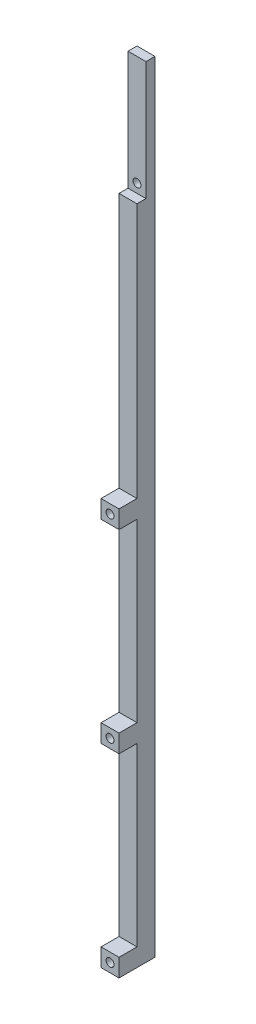
ISO-10303-21;
HEADER;
FILE_DESCRIPTION(('STEP AP214'),'2;1');
FILE_NAME('part.step','',(''),(''),'','','');
FILE_SCHEMA(('AUTOMOTIVE_DESIGN { 1 0 10303 214 1 1 1 1 }'));
ENDSEC;
DATA;
#1=APPLICATION_CONTEXT('core data for automotive mechanical design processes');
#2=APPLICATION_PROTOCOL_DEFINITION('international standard','automotive_design',2000,#1);
#3=PRODUCT_CONTEXT('',#1,'mechanical');
#4=PRODUCT('Part','Part','',(#3));
#5=PRODUCT_RELATED_PRODUCT_CATEGORY('part','',(#4));
#6=PRODUCT_DEFINITION_FORMATION('','',#4);
#7=PRODUCT_DEFINITION_CONTEXT('part definition',#1,'design');
#8=PRODUCT_DEFINITION('design','',#6,#7);
#9=PRODUCT_DEFINITION_SHAPE('','',#8);
#10=(LENGTH_UNIT() NAMED_UNIT(*) SI_UNIT(.MILLI.,.METRE.));
#11=(NAMED_UNIT(*) PLANE_ANGLE_UNIT() SI_UNIT($,.RADIAN.));
#12=(NAMED_UNIT(*) SI_UNIT($,.STERADIAN.) SOLID_ANGLE_UNIT());
#13=UNCERTAINTY_MEASURE_WITH_UNIT(LENGTH_MEASURE(1.E-05),#10,'distance_accuracy_value','');
#14=(GEOMETRIC_REPRESENTATION_CONTEXT(3) GLOBAL_UNCERTAINTY_ASSIGNED_CONTEXT((#13)) GLOBAL_UNIT_ASSIGNED_CONTEXT((#10,
#11,#12)) REPRESENTATION_CONTEXT('',''));
#15=CARTESIAN_POINT('',(0.,0.,0.));
#16=DIRECTION('',(0.,0.,1.));
#17=DIRECTION('',(1.,0.,0.));
#18=AXIS2_PLACEMENT_3D('',#15,#16,#17);
#19=CARTESIAN_POINT('',(0.,275.59,0.));
#20=DIRECTION('',(0.,0.,-1.));
#21=DIRECTION('',(-1.,0.,0.));
#22=AXIS2_PLACEMENT_3D('',#19,#20,#21);
#23=PLANE('',#22);
#24=CARTESIAN_POINT('',(3.175,140.335,0.));
#25=DIRECTION('',(0.,0.,1.));
#26=DIRECTION('',(1.,0.,0.));
#27=AXIS2_PLACEMENT_3D('',#24,#25,#26);
#28=CIRCLE('',#27,1.397);
#29=CARTESIAN_POINT('',(4.57199999999999,140.335,0.));
#30=VERTEX_POINT('',#29);
#31=EDGE_CURVE('E416',#30,#30,#28,.T.);
#32=ORIENTED_EDGE('',*,*,#31,.F.);
#33=EDGE_LOOP('',(#32));
#34=FACE_BOUND('',#33,.T.);
#35=DIRECTION('',(0.,-1.,0.));
#36=VECTOR('',#35,1.);
#37=CARTESIAN_POINT('',(6.35,275.59,0.));
#38=LINE('',#37,#36);
#39=CARTESIAN_POINT('',(6.35,143.50989967,0.));
#40=VERTEX_POINT('',#39);
#41=CARTESIAN_POINT('',(6.35,137.16010033,0.));
#42=VERTEX_POINT('',#41);
#43=EDGE_CURVE('E226',#40,#42,#38,.T.);
#44=ORIENTED_EDGE('',*,*,#43,.F.);
#45=DIRECTION('',(-1.,0.,0.));
#46=VECTOR('',#45,1.);
#47=CARTESIAN_POINT('',(0.,143.50989967,0.));
#48=LINE('',#47,#46);
#49=CARTESIAN_POINT('',(0.,143.50989967,0.));
#50=VERTEX_POINT('',#49);
#51=EDGE_CURVE('E147',#40,#50,#48,.T.);
#52=ORIENTED_EDGE('',*,*,#51,.T.);
#53=DIRECTION('',(0.,-1.,0.));
#54=VECTOR('',#53,1.);
#55=CARTESIAN_POINT('',(0.,275.59,0.));
#56=LINE('',#55,#54);
#57=CARTESIAN_POINT('',(0.,137.16010033,0.));
#58=VERTEX_POINT('',#57);
#59=EDGE_CURVE('E222',#50,#58,#56,.T.);
#60=ORIENTED_EDGE('',*,*,#59,.T.);
#61=DIRECTION('',(1.,0.,0.));
#62=VECTOR('',#61,1.);
#63=CARTESIAN_POINT('',(0.,137.16010033,0.));
#64=LINE('',#63,#62);
#65=EDGE_CURVE('E221',#58,#42,#64,.T.);
#66=ORIENTED_EDGE('',*,*,#65,.T.);
#67=EDGE_LOOP('',(#44,#52,#60,#66));
#68=FACE_BOUND('',#67,.T.);
#69=ADVANCED_FACE('F129',(#34,#68),#23,.F.);
#70=CARTESIAN_POINT('',(3.17500000000003,3.175,0.));
#71=DIRECTION('',(0.,0.,1.));
#72=DIRECTION('',(1.,0.,0.));
#73=AXIS2_PLACEMENT_3D('',#70,#71,#72);
#74=CIRCLE('',#73,1.397);
#75=CARTESIAN_POINT('',(4.57200000000002,3.175,0.));
#76=VERTEX_POINT('',#75);
#77=EDGE_CURVE('E413',#76,#76,#74,.T.);
#78=ORIENTED_EDGE('',*,*,#77,.F.);
#79=EDGE_LOOP('',(#78));
#80=FACE_BOUND('',#79,.T.);
#81=DIRECTION('',(1.,0.,0.));
#82=VECTOR('',#81,1.);
#83=CARTESIAN_POINT('',(0.,6.34989966999999,0.));
#84=LINE('',#83,#82);
#85=CARTESIAN_POINT('',(0.,6.34989967,0.));
#86=VERTEX_POINT('',#85);
#87=CARTESIAN_POINT('',(6.35,6.34989967,0.));
#88=VERTEX_POINT('',#87);
#89=EDGE_CURVE('E258',#86,#88,#84,.T.);
#90=ORIENTED_EDGE('',*,*,#89,.F.);
#91=CARTESIAN_POINT('',(0.,0.,0.));
#92=VERTEX_POINT('',#91);
#93=EDGE_CURVE('E217',#86,#92,#56,.T.);
#94=ORIENTED_EDGE('',*,*,#93,.T.);
#95=DIRECTION('',(1.,0.,0.));
#96=VECTOR('',#95,1.);
#97=CARTESIAN_POINT('',(0.,0.,0.));
#98=LINE('',#97,#96);
#99=CARTESIAN_POINT('',(6.35,0.,0.));
#100=VERTEX_POINT('',#99);
#101=EDGE_CURVE('E220',#92,#100,#98,.T.);
#102=ORIENTED_EDGE('',*,*,#101,.T.);
#103=EDGE_CURVE('E206',#88,#100,#38,.T.);
#104=ORIENTED_EDGE('',*,*,#103,.F.);
#105=EDGE_LOOP('',(#90,#94,#102,#104));
#106=FACE_BOUND('',#105,.T.);
#107=ADVANCED_FACE('F392',(#80,#106),#23,.F.);
#108=CARTESIAN_POINT('',(3.175,71.755,0.));
#109=DIRECTION('',(0.,0.,1.));
#110=DIRECTION('',(1.,0.,0.));
#111=AXIS2_PLACEMENT_3D('',#108,#109,#110);
#112=CIRCLE('',#111,1.397);
#113=CARTESIAN_POINT('',(4.572,71.755,0.));
#114=VERTEX_POINT('',#113);
#115=EDGE_CURVE('E407',#114,#114,#112,.T.);
#116=ORIENTED_EDGE('',*,*,#115,.F.);
#117=EDGE_LOOP('',(#116));
#118=FACE_BOUND('',#117,.T.);
#119=CARTESIAN_POINT('',(0.,74.92989967,0.));
#120=VERTEX_POINT('',#119);
#121=CARTESIAN_POINT('',(0.,68.58010033,0.));
#122=VERTEX_POINT('',#121);
#123=EDGE_CURVE('E223',#120,#122,#56,.T.);
#124=ORIENTED_EDGE('',*,*,#123,.T.);
#125=DIRECTION('',(1.,0.,0.));
#126=VECTOR('',#125,1.);
#127=CARTESIAN_POINT('',(0.,68.58010033,0.));
#128=LINE('',#127,#126);
#129=CARTESIAN_POINT('',(6.35,68.58010033,0.));
#130=VERTEX_POINT('',#129);
#131=EDGE_CURVE('E215',#122,#130,#128,.T.);
#132=ORIENTED_EDGE('',*,*,#131,.T.);
#133=CARTESIAN_POINT('',(6.35,74.92989967,0.));
#134=VERTEX_POINT('',#133);
#135=EDGE_CURVE('E227',#134,#130,#38,.T.);
#136=ORIENTED_EDGE('',*,*,#135,.F.);
#137=DIRECTION('',(1.,0.,0.));
#138=VECTOR('',#137,1.);
#139=CARTESIAN_POINT('',(0.,74.92989967,0.));
#140=LINE('',#139,#138);
#141=EDGE_CURVE('E275',#120,#134,#140,.T.);
#142=ORIENTED_EDGE('',*,*,#141,.F.);
#143=EDGE_LOOP('',(#124,#132,#136,#142));
#144=FACE_BOUND('',#143,.T.);
#145=ADVANCED_FACE('F328',(#118,#144),#23,.F.);
#146=CARTESIAN_POINT('',(0.,275.59,0.));
#147=DIRECTION('',(1.,0.,0.));
#148=DIRECTION('',(0.,0.,-1.));
#149=AXIS2_PLACEMENT_3D('',#146,#147,#148);
#150=PLANE('',#149);
#151=ORIENTED_EDGE('',*,*,#59,.F.);
#152=DIRECTION('',(0.,0.,1.));
#153=VECTOR('',#152,1.);
#154=CARTESIAN_POINT('',(0.,143.50989967,0.));
#155=LINE('',#154,#153);
#156=CARTESIAN_POINT('',(0.,143.50989967,-6.35010033));
#157=VERTEX_POINT('',#156);
#158=EDGE_CURVE('E12',#157,#50,#155,.T.);
#159=ORIENTED_EDGE('',*,*,#158,.F.);
#160=DIRECTION('',(0.,1.,0.));
#161=VECTOR('',#160,1.);
#162=CARTESIAN_POINT('',(0.,143.51,-6.35010033));
#163=LINE('',#162,#161);
#164=CARTESIAN_POINT('',(0.,233.67989967,-6.35010033));
#165=VERTEX_POINT('',#164);
#166=EDGE_CURVE('E192',#165,#157,#163,.F.);
#167=ORIENTED_EDGE('',*,*,#166,.F.);
#168=DIRECTION('',(0.,0.,-1.));
#169=VECTOR('',#168,1.);
#170=CARTESIAN_POINT('',(0.,233.67989967,6.80936496078033E-13));
#171=LINE('',#170,#169);
#172=CARTESIAN_POINT('',(0.,233.67989967,-9.52510033));
#173=VERTEX_POINT('',#172);
#174=EDGE_CURVE('E213',#165,#173,#171,.T.);
#175=ORIENTED_EDGE('',*,*,#174,.T.);
#176=DIRECTION('',(0.,-1.,0.));
#177=VECTOR('',#176,1.);
#178=CARTESIAN_POINT('',(0.,0.,-9.52510033));
#179=LINE('',#178,#177);
#180=CARTESIAN_POINT('',(0.,275.59,-9.52510033));
#181=VERTEX_POINT('',#180);
#182=EDGE_CURVE('E191',#181,#173,#179,.T.);
#183=ORIENTED_EDGE('',*,*,#182,.F.);
#184=DIRECTION('',(0.,0.,1.));
#185=VECTOR('',#184,1.);
#186=CARTESIAN_POINT('',(0.,275.59,0.));
#187=LINE('',#186,#185);
#188=CARTESIAN_POINT('',(0.,275.59,-12.7));
#189=VERTEX_POINT('',#188);
#190=EDGE_CURVE('E133',#189,#181,#187,.T.);
#191=ORIENTED_EDGE('',*,*,#190,.F.);
#192=DIRECTION('',(0.,-1.,0.));
#193=VECTOR('',#192,1.);
#194=CARTESIAN_POINT('',(0.,275.59,-12.7));
#195=LINE('',#194,#193);
#196=CARTESIAN_POINT('',(0.,0.,-12.7));
#197=VERTEX_POINT('',#196);
#198=EDGE_CURVE('E214',#189,#197,#195,.T.);
#199=ORIENTED_EDGE('',*,*,#198,.T.);
#200=DIRECTION('',(0.,0.,1.));
#201=VECTOR('',#200,1.);
#202=CARTESIAN_POINT('',(0.,0.,0.));
#203=LINE('',#202,#201);
#204=EDGE_CURVE('E252',#197,#92,#203,.T.);
#205=ORIENTED_EDGE('',*,*,#204,.T.);
#206=ORIENTED_EDGE('',*,*,#93,.F.);
#207=DIRECTION('',(0.,0.,-1.));
#208=VECTOR('',#207,1.);
#209=CARTESIAN_POINT('',(0.,6.34989967,0.));
#210=LINE('',#209,#208);
#211=CARTESIAN_POINT('',(0.,6.34989967,-6.35010032999999));
#212=VERTEX_POINT('',#211);
#213=EDGE_CURVE('E248',#86,#212,#210,.T.);
#214=ORIENTED_EDGE('',*,*,#213,.T.);
#215=DIRECTION('',(0.,-1.,0.));
#216=VECTOR('',#215,1.);
#217=CARTESIAN_POINT('',(0.,68.58,-6.35010033));
#218=LINE('',#217,#216);
#219=CARTESIAN_POINT('',(0.,68.58010033,-6.35010033));
#220=VERTEX_POINT('',#219);
#221=EDGE_CURVE('E243',#220,#212,#218,.T.);
#222=ORIENTED_EDGE('',*,*,#221,.F.);
#223=DIRECTION('',(0.,0.,-1.));
#224=VECTOR('',#223,1.);
#225=CARTESIAN_POINT('',(0.,68.58010033,0.));
#226=LINE('',#225,#224);
#227=EDGE_CURVE('E255',#122,#220,#226,.T.);
#228=ORIENTED_EDGE('',*,*,#227,.F.);
#229=ORIENTED_EDGE('',*,*,#123,.F.);
#230=DIRECTION('',(0.,0.,-1.));
#231=VECTOR('',#230,1.);
#232=CARTESIAN_POINT('',(0.,74.92989967,0.));
#233=LINE('',#232,#231);
#234=CARTESIAN_POINT('',(0.,74.92989967,-6.35010032999999));
#235=VERTEX_POINT('',#234);
#236=EDGE_CURVE('E251',#120,#235,#233,.T.);
#237=ORIENTED_EDGE('',*,*,#236,.T.);
#238=DIRECTION('',(0.,-1.,0.));
#239=VECTOR('',#238,1.);
#240=CARTESIAN_POINT('',(0.,137.16,-6.35010033));
#241=LINE('',#240,#239);
#242=CARTESIAN_POINT('',(0.,137.16010033,-6.35010033));
#243=VERTEX_POINT('',#242);
#244=EDGE_CURVE('E290',#243,#235,#241,.T.);
#245=ORIENTED_EDGE('',*,*,#244,.F.);
#246=DIRECTION('',(0.,0.,-1.));
#247=VECTOR('',#246,1.);
#248=CARTESIAN_POINT('',(0.,137.16010033,0.));
#249=LINE('',#248,#247);
#250=EDGE_CURVE('E233',#58,#243,#249,.T.);
#251=ORIENTED_EDGE('',*,*,#250,.F.);
#252=EDGE_LOOP('',(#151,#159,#167,#175,#183,#191,#199,#205,#206,#214,#222,#228,#229,#237,#245,#251));
#253=FACE_BOUND('',#252,.T.);
#254=ADVANCED_FACE('F131',(#253),#150,.F.);
#255=CARTESIAN_POINT('',(6.35,275.59,0.));
#256=DIRECTION('',(-1.,0.,0.));
#257=DIRECTION('',(0.,0.,1.));
#258=AXIS2_PLACEMENT_3D('',#255,#256,#257);
#259=PLANE('',#258);
#260=DIRECTION('',(0.,1.,0.));
#261=VECTOR('',#260,1.);
#262=CARTESIAN_POINT('',(6.35,143.51,-6.35010033));
#263=LINE('',#262,#261);
#264=CARTESIAN_POINT('',(6.35,233.67989967,-6.35010033));
#265=VERTEX_POINT('',#264);
#266=CARTESIAN_POINT('',(6.35,143.50989967,-6.35010033));
#267=VERTEX_POINT('',#266);
#268=EDGE_CURVE('E295',#265,#267,#263,.F.);
#269=ORIENTED_EDGE('',*,*,#268,.T.);
#270=DIRECTION('',(0.,0.,1.));
#271=VECTOR('',#270,1.);
#272=CARTESIAN_POINT('',(6.35,143.50989967,0.));
#273=LINE('',#272,#271);
#274=EDGE_CURVE('E308',#267,#40,#273,.T.);
#275=ORIENTED_EDGE('',*,*,#274,.T.);
#276=ORIENTED_EDGE('',*,*,#43,.T.);
#277=DIRECTION('',(0.,0.,-1.));
#278=VECTOR('',#277,1.);
#279=CARTESIAN_POINT('',(6.35,137.16010033,0.));
#280=LINE('',#279,#278);
#281=CARTESIAN_POINT('',(6.35,137.16010033,-6.35010033));
#282=VERTEX_POINT('',#281);
#283=EDGE_CURVE('E267',#42,#282,#280,.T.);
#284=ORIENTED_EDGE('',*,*,#283,.T.);
#285=DIRECTION('',(0.,-1.,0.));
#286=VECTOR('',#285,1.);
#287=CARTESIAN_POINT('',(6.35,137.16,-6.35010033));
#288=LINE('',#287,#286);
#289=CARTESIAN_POINT('',(6.35,74.92989967,-6.35010033));
#290=VERTEX_POINT('',#289);
#291=EDGE_CURVE('E270',#282,#290,#288,.T.);
#292=ORIENTED_EDGE('',*,*,#291,.T.);
#293=DIRECTION('',(0.,0.,-1.));
#294=VECTOR('',#293,1.);
#295=CARTESIAN_POINT('',(6.35,74.92989967,0.));
#296=LINE('',#295,#294);
#297=EDGE_CURVE('E271',#134,#290,#296,.T.);
#298=ORIENTED_EDGE('',*,*,#297,.F.);
#299=ORIENTED_EDGE('',*,*,#135,.T.);
#300=DIRECTION('',(0.,0.,-1.));
#301=VECTOR('',#300,1.);
#302=CARTESIAN_POINT('',(6.35,68.58010033,0.));
#303=LINE('',#302,#301);
#304=CARTESIAN_POINT('',(6.35,68.58010033,-6.35010033));
#305=VERTEX_POINT('',#304);
#306=EDGE_CURVE('E262',#130,#305,#303,.T.);
#307=ORIENTED_EDGE('',*,*,#306,.T.);
#308=DIRECTION('',(0.,-1.,0.));
#309=VECTOR('',#308,1.);
#310=CARTESIAN_POINT('',(6.35,68.58,-6.35010033));
#311=LINE('',#310,#309);
#312=CARTESIAN_POINT('',(6.35,6.34989966999999,-6.35010032999999));
#313=VERTEX_POINT('',#312);
#314=EDGE_CURVE('E225',#305,#313,#311,.T.);
#315=ORIENTED_EDGE('',*,*,#314,.T.);
#316=DIRECTION('',(0.,0.,-1.));
#317=VECTOR('',#316,1.);
#318=CARTESIAN_POINT('',(6.35,6.34989966999999,0.));
#319=LINE('',#318,#317);
#320=EDGE_CURVE('E247',#88,#313,#319,.T.);
#321=ORIENTED_EDGE('',*,*,#320,.F.);
#322=ORIENTED_EDGE('',*,*,#103,.T.);
#323=DIRECTION('',(0.,0.,-1.));
#324=VECTOR('',#323,1.);
#325=CARTESIAN_POINT('',(6.35,0.,0.));
#326=LINE('',#325,#324);
#327=CARTESIAN_POINT('',(6.35,0.,-12.7));
#328=VERTEX_POINT('',#327);
#329=EDGE_CURVE('E200',#100,#328,#326,.T.);
#330=ORIENTED_EDGE('',*,*,#329,.T.);
#331=DIRECTION('',(0.,-1.,0.));
#332=VECTOR('',#331,1.);
#333=CARTESIAN_POINT('',(6.35,275.59,-12.7));
#334=LINE('',#333,#332);
#335=CARTESIAN_POINT('',(6.35,275.59,-12.7));
#336=VERTEX_POINT('',#335);
#337=EDGE_CURVE('E203',#336,#328,#334,.T.);
#338=ORIENTED_EDGE('',*,*,#337,.F.);
#339=DIRECTION('',(0.,0.,-1.));
#340=VECTOR('',#339,1.);
#341=CARTESIAN_POINT('',(6.35,275.59,0.));
#342=LINE('',#341,#340);
#343=CARTESIAN_POINT('',(6.35,275.59,-9.52510033));
#344=VERTEX_POINT('',#343);
#345=EDGE_CURVE('E198',#344,#336,#342,.T.);
#346=ORIENTED_EDGE('',*,*,#345,.F.);
#347=DIRECTION('',(0.,-1.,0.));
#348=VECTOR('',#347,1.);
#349=CARTESIAN_POINT('',(6.35,0.,-9.52510033));
#350=LINE('',#349,#348);
#351=CARTESIAN_POINT('',(6.35,233.67989967,-9.52510033));
#352=VERTEX_POINT('',#351);
#353=EDGE_CURVE('E188',#344,#352,#350,.T.);
#354=ORIENTED_EDGE('',*,*,#353,.T.);
#355=DIRECTION('',(0.,0.,-1.));
#356=VECTOR('',#355,1.);
#357=CARTESIAN_POINT('',(6.35,233.67989967,6.79201772602056E-13));
#358=LINE('',#357,#356);
#359=EDGE_CURVE('E172',#265,#352,#358,.T.);
#360=ORIENTED_EDGE('',*,*,#359,.F.);
#361=EDGE_LOOP('',(#269,#275,#276,#284,#292,#298,#299,#307,#315,#321,#322,#330,#338,#346,#354,#360));
#362=FACE_BOUND('',#361,.T.);
#363=ADVANCED_FACE('F195',(#362),#259,.F.);
#364=CARTESIAN_POINT('',(0.,275.59,-12.7));
#365=DIRECTION('',(0.,0.,1.));
#366=DIRECTION('',(1.,0.,0.));
#367=AXIS2_PLACEMENT_3D('',#364,#365,#366);
#368=PLANE('',#367);
#369=CARTESIAN_POINT('',(3.175,236.855,-12.7));
#370=DIRECTION('',(0.,0.,1.));
#371=DIRECTION('',(1.,0.,0.));
#372=AXIS2_PLACEMENT_3D('',#369,#370,#371);
#373=CIRCLE('',#372,1.397);
#374=CARTESIAN_POINT('',(4.57199999999999,236.855,-12.7));
#375=VERTEX_POINT('',#374);
#376=EDGE_CURVE('E614',#375,#375,#373,.T.);
#377=ORIENTED_EDGE('',*,*,#376,.T.);
#378=EDGE_LOOP('',(#377));
#379=FACE_BOUND('',#378,.T.);
#380=CARTESIAN_POINT('',(3.175,140.335,-12.7));
#381=DIRECTION('',(0.,0.,1.));
#382=DIRECTION('',(1.,0.,0.));
#383=AXIS2_PLACEMENT_3D('',#380,#381,#382);
#384=CIRCLE('',#383,1.397);
#385=CARTESIAN_POINT('',(4.57199999999999,140.335,-12.7));
#386=VERTEX_POINT('',#385);
#387=EDGE_CURVE('E410',#386,#386,#384,.T.);
#388=ORIENTED_EDGE('',*,*,#387,.T.);
#389=EDGE_LOOP('',(#388));
#390=FACE_BOUND('',#389,.T.);
#391=CARTESIAN_POINT('',(3.175,71.755,-12.7));
#392=DIRECTION('',(0.,0.,1.));
#393=DIRECTION('',(1.,0.,0.));
#394=AXIS2_PLACEMENT_3D('',#391,#392,#393);
#395=CIRCLE('',#394,1.397);
#396=CARTESIAN_POINT('',(4.57199999999999,71.755,-12.7));
#397=VERTEX_POINT('',#396);
#398=EDGE_CURVE('E409',#397,#397,#395,.T.);
#399=ORIENTED_EDGE('',*,*,#398,.T.);
#400=EDGE_LOOP('',(#399));
#401=FACE_BOUND('',#400,.T.);
#402=CARTESIAN_POINT('',(3.17500000000003,3.175,-12.7));
#403=DIRECTION('',(0.,0.,1.));
#404=DIRECTION('',(1.,0.,0.));
#405=AXIS2_PLACEMENT_3D('',#402,#403,#404);
#406=CIRCLE('',#405,1.397);
#407=CARTESIAN_POINT('',(4.57200000000002,3.175,-12.7));
#408=VERTEX_POINT('',#407);
#409=EDGE_CURVE('E239',#408,#408,#406,.T.);
#410=ORIENTED_EDGE('',*,*,#409,.T.);
#411=EDGE_LOOP('',(#410));
#412=FACE_BOUND('',#411,.T.);
#413=DIRECTION('',(-1.,0.,0.));
#414=VECTOR('',#413,1.);
#415=CARTESIAN_POINT('',(0.,0.,-12.7));
#416=LINE('',#415,#414);
#417=EDGE_CURVE('E199',#328,#197,#416,.T.);
#418=ORIENTED_EDGE('',*,*,#417,.T.);
#419=ORIENTED_EDGE('',*,*,#198,.F.);
#420=DIRECTION('',(-1.,0.,0.));
#421=VECTOR('',#420,1.);
#422=CARTESIAN_POINT('',(0.,275.59,-12.7));
#423=LINE('',#422,#421);
#424=EDGE_CURVE('E228',#336,#189,#423,.T.);
#425=ORIENTED_EDGE('',*,*,#424,.F.);
#426=ORIENTED_EDGE('',*,*,#337,.T.);
#427=EDGE_LOOP('',(#418,#419,#425,#426));
#428=FACE_BOUND('',#427,.T.);
#429=ADVANCED_FACE('F425',(#379,#390,#401,#412,#428),#368,.F.);
#430=CARTESIAN_POINT('',(0.,275.59,0.));
#431=DIRECTION('',(0.,-1.,0.));
#432=DIRECTION('',(0.,0.,-1.));
#433=AXIS2_PLACEMENT_3D('',#430,#431,#432);
#434=PLANE('',#433);
#435=ORIENTED_EDGE('',*,*,#190,.T.);
#436=DIRECTION('',(1.,0.,0.));
#437=VECTOR('',#436,1.);
#438=CARTESIAN_POINT('',(0.,275.59,-9.52510033));
#439=LINE('',#438,#437);
#440=EDGE_CURVE('E229',#181,#344,#439,.T.);
#441=ORIENTED_EDGE('',*,*,#440,.T.);
#442=ORIENTED_EDGE('',*,*,#345,.T.);
#443=ORIENTED_EDGE('',*,*,#424,.T.);
#444=EDGE_LOOP('',(#435,#441,#442,#443));
#445=FACE_BOUND('',#444,.T.);
#446=ADVANCED_FACE('F456',(#445),#434,.F.);
#447=CARTESIAN_POINT('',(0.,0.,0.));
#448=DIRECTION('',(0.,-1.,0.));
#449=DIRECTION('',(0.,0.,-1.));
#450=AXIS2_PLACEMENT_3D('',#447,#448,#449);
#451=PLANE('',#450);
#452=ORIENTED_EDGE('',*,*,#204,.F.);
#453=ORIENTED_EDGE('',*,*,#417,.F.);
#454=ORIENTED_EDGE('',*,*,#329,.F.);
#455=ORIENTED_EDGE('',*,*,#101,.F.);
#456=EDGE_LOOP('',(#452,#453,#454,#455));
#457=FACE_BOUND('',#456,.T.);
#458=ADVANCED_FACE('F458',(#457),#451,.T.);
#459=CARTESIAN_POINT('',(6.35,137.16010033,0.));
#460=DIRECTION('',(0.,1.,0.));
#461=DIRECTION('',(0.,0.,1.));
#462=AXIS2_PLACEMENT_3D('',#459,#460,#461);
#463=PLANE('',#462);
#464=ORIENTED_EDGE('',*,*,#250,.T.);
#465=DIRECTION('',(-1.,0.,0.));
#466=VECTOR('',#465,1.);
#467=CARTESIAN_POINT('',(6.35,137.16010033,-6.35010033));
#468=LINE('',#467,#466);
#469=EDGE_CURVE('E259',#282,#243,#468,.T.);
#470=ORIENTED_EDGE('',*,*,#469,.F.);
#471=ORIENTED_EDGE('',*,*,#283,.F.);
#472=ORIENTED_EDGE('',*,*,#65,.F.);
#473=EDGE_LOOP('',(#464,#470,#471,#472));
#474=FACE_BOUND('',#473,.T.);
#475=ADVANCED_FACE('F389',(#474),#463,.F.);
#476=CARTESIAN_POINT('',(6.35,74.92989967,0.));
#477=DIRECTION('',(0.,1.,0.));
#478=DIRECTION('',(0.,0.,1.));
#479=AXIS2_PLACEMENT_3D('',#476,#477,#478);
#480=PLANE('',#479);
#481=ORIENTED_EDGE('',*,*,#141,.T.);
#482=ORIENTED_EDGE('',*,*,#297,.T.);
#483=DIRECTION('',(-1.,0.,0.));
#484=VECTOR('',#483,1.);
#485=CARTESIAN_POINT('',(6.35,74.92989967,-6.35010033));
#486=LINE('',#485,#484);
#487=EDGE_CURVE('E274',#290,#235,#486,.T.);
#488=ORIENTED_EDGE('',*,*,#487,.T.);
#489=ORIENTED_EDGE('',*,*,#236,.F.);
#490=EDGE_LOOP('',(#481,#482,#488,#489));
#491=FACE_BOUND('',#490,.T.);
#492=ADVANCED_FACE('F464',(#491),#480,.T.);
#493=CARTESIAN_POINT('',(6.35,137.16,-6.35010033));
#494=DIRECTION('',(0.,0.,-1.));
#495=DIRECTION('',(-1.,0.,0.));
#496=AXIS2_PLACEMENT_3D('',#493,#494,#495);
#497=PLANE('',#496);
#498=ORIENTED_EDGE('',*,*,#244,.T.);
#499=ORIENTED_EDGE('',*,*,#487,.F.);
#500=ORIENTED_EDGE('',*,*,#291,.F.);
#501=ORIENTED_EDGE('',*,*,#469,.T.);
#502=EDGE_LOOP('',(#498,#499,#500,#501));
#503=FACE_BOUND('',#502,.T.);
#504=ADVANCED_FACE('F447',(#503),#497,.F.);
#505=CARTESIAN_POINT('',(6.35,68.58010033,0.));
#506=DIRECTION('',(0.,1.,0.));
#507=DIRECTION('',(0.,0.,1.));
#508=AXIS2_PLACEMENT_3D('',#505,#506,#507);
#509=PLANE('',#508);
#510=ORIENTED_EDGE('',*,*,#227,.T.);
#511=DIRECTION('',(-1.,0.,0.));
#512=VECTOR('',#511,1.);
#513=CARTESIAN_POINT('',(6.35,68.58010033,-6.35010033));
#514=LINE('',#513,#512);
#515=EDGE_CURVE('E210',#305,#220,#514,.T.);
#516=ORIENTED_EDGE('',*,*,#515,.F.);
#517=ORIENTED_EDGE('',*,*,#306,.F.);
#518=ORIENTED_EDGE('',*,*,#131,.F.);
#519=EDGE_LOOP('',(#510,#516,#517,#518));
#520=FACE_BOUND('',#519,.T.);
#521=ADVANCED_FACE('F443',(#520),#509,.F.);
#522=CARTESIAN_POINT('',(6.35,6.34989967,0.));
#523=DIRECTION('',(0.,1.,0.));
#524=DIRECTION('',(0.,0.,1.));
#525=AXIS2_PLACEMENT_3D('',#522,#523,#524);
#526=PLANE('',#525);
#527=ORIENTED_EDGE('',*,*,#89,.T.);
#528=ORIENTED_EDGE('',*,*,#320,.T.);
#529=DIRECTION('',(-1.,0.,0.));
#530=VECTOR('',#529,1.);
#531=CARTESIAN_POINT('',(6.35,6.34989967,-6.35010032999999));
#532=LINE('',#531,#530);
#533=EDGE_CURVE('E244',#313,#212,#532,.T.);
#534=ORIENTED_EDGE('',*,*,#533,.T.);
#535=ORIENTED_EDGE('',*,*,#213,.F.);
#536=EDGE_LOOP('',(#527,#528,#534,#535));
#537=FACE_BOUND('',#536,.T.);
#538=ADVANCED_FACE('F446',(#537),#526,.T.);
#539=CARTESIAN_POINT('',(6.35,68.58,-6.35010033));
#540=DIRECTION('',(0.,0.,-1.));
#541=DIRECTION('',(-1.,0.,0.));
#542=AXIS2_PLACEMENT_3D('',#539,#540,#541);
#543=PLANE('',#542);
#544=ORIENTED_EDGE('',*,*,#221,.T.);
#545=ORIENTED_EDGE('',*,*,#533,.F.);
#546=ORIENTED_EDGE('',*,*,#314,.F.);
#547=ORIENTED_EDGE('',*,*,#515,.T.);
#548=EDGE_LOOP('',(#544,#545,#546,#547));
#549=FACE_BOUND('',#548,.T.);
#550=ADVANCED_FACE('F449',(#549),#543,.F.);
#551=CARTESIAN_POINT('',(6.35,0.,-9.52510033));
#552=DIRECTION('',(0.,0.,-1.));
#553=DIRECTION('',(-1.,0.,0.));
#554=AXIS2_PLACEMENT_3D('',#551,#552,#553);
#555=PLANE('',#554);
#556=CARTESIAN_POINT('',(3.175,236.855,-9.52510033));
#557=DIRECTION('',(0.,0.,-1.));
#558=DIRECTION('',(-1.,0.,0.));
#559=AXIS2_PLACEMENT_3D('',#556,#557,#558);
#560=CIRCLE('',#559,1.397);
#561=CARTESIAN_POINT('',(1.778,236.855,-9.52510033));
#562=VERTEX_POINT('',#561);
#563=EDGE_CURVE('E617',#562,#562,#560,.T.);
#564=ORIENTED_EDGE('',*,*,#563,.T.);
#565=EDGE_LOOP('',(#564));
#566=FACE_BOUND('',#565,.T.);
#567=ORIENTED_EDGE('',*,*,#182,.T.);
#568=DIRECTION('',(-1.,0.,0.));
#569=VECTOR('',#568,1.);
#570=CARTESIAN_POINT('',(6.35,233.67989967,-9.52510033));
#571=LINE('',#570,#569);
#572=EDGE_CURVE('E176',#352,#173,#571,.T.);
#573=ORIENTED_EDGE('',*,*,#572,.F.);
#574=ORIENTED_EDGE('',*,*,#353,.F.);
#575=ORIENTED_EDGE('',*,*,#440,.F.);
#576=EDGE_LOOP('',(#567,#573,#574,#575));
#577=FACE_BOUND('',#576,.T.);
#578=ADVANCED_FACE('F187',(#566,#577),#555,.F.);
#579=CARTESIAN_POINT('',(6.35,233.67989967,6.79201772602056E-13));
#580=DIRECTION('',(0.,1.,0.));
#581=DIRECTION('',(0.,0.,1.));
#582=AXIS2_PLACEMENT_3D('',#579,#580,#581);
#583=PLANE('',#582);
#584=DIRECTION('',(1.,0.,0.));
#585=VECTOR('',#584,1.);
#586=CARTESIAN_POINT('',(6.35,233.67989967,-6.35010033));
#587=LINE('',#586,#585);
#588=EDGE_CURVE('E178',#165,#265,#587,.T.);
#589=ORIENTED_EDGE('',*,*,#588,.T.);
#590=ORIENTED_EDGE('',*,*,#359,.T.);
#591=ORIENTED_EDGE('',*,*,#572,.T.);
#592=ORIENTED_EDGE('',*,*,#174,.F.);
#593=EDGE_LOOP('',(#589,#590,#591,#592));
#594=FACE_BOUND('',#593,.T.);
#595=ADVANCED_FACE('F174',(#594),#583,.T.);
#596=CARTESIAN_POINT('',(6.35,143.51,-6.35010033));
#597=DIRECTION('',(0.,0.,-1.));
#598=DIRECTION('',(-1.,0.,0.));
#599=AXIS2_PLACEMENT_3D('',#596,#597,#598);
#600=PLANE('',#599);
#601=ORIENTED_EDGE('',*,*,#166,.T.);
#602=DIRECTION('',(-1.,0.,0.));
#603=VECTOR('',#602,1.);
#604=CARTESIAN_POINT('',(6.35,143.50989967,-6.35010033));
#605=LINE('',#604,#603);
#606=EDGE_CURVE('E139',#267,#157,#605,.T.);
#607=ORIENTED_EDGE('',*,*,#606,.F.);
#608=ORIENTED_EDGE('',*,*,#268,.F.);
#609=ORIENTED_EDGE('',*,*,#588,.F.);
#610=EDGE_LOOP('',(#601,#607,#608,#609));
#611=FACE_BOUND('',#610,.T.);
#612=ADVANCED_FACE('F439',(#611),#600,.F.);
#613=CARTESIAN_POINT('',(6.35,143.50989967,0.));
#614=DIRECTION('',(0.,-1.,0.));
#615=DIRECTION('',(0.,0.,-1.));
#616=AXIS2_PLACEMENT_3D('',#613,#614,#615);
#617=PLANE('',#616);
#618=ORIENTED_EDGE('',*,*,#274,.F.);
#619=ORIENTED_EDGE('',*,*,#606,.T.);
#620=ORIENTED_EDGE('',*,*,#158,.T.);
#621=ORIENTED_EDGE('',*,*,#51,.F.);
#622=EDGE_LOOP('',(#618,#619,#620,#621));
#623=FACE_BOUND('',#622,.T.);
#624=ADVANCED_FACE('F314',(#623),#617,.F.);
#625=CARTESIAN_POINT('',(3.17500000000003,3.175,0.));
#626=DIRECTION('',(0.,0.,1.));
#627=DIRECTION('',(1.,0.,0.));
#628=AXIS2_PLACEMENT_3D('',#625,#626,#627);
#629=CYLINDRICAL_SURFACE('',#628,1.397);
#630=ORIENTED_EDGE('',*,*,#409,.F.);
#631=EDGE_LOOP('',(#630));
#632=FACE_BOUND('',#631,.T.);
#633=ORIENTED_EDGE('',*,*,#77,.T.);
#634=EDGE_LOOP('',(#633));
#635=FACE_BOUND('',#634,.T.);
#636=ADVANCED_FACE('F428',(#632,#635),#629,.F.);
#637=CARTESIAN_POINT('',(3.175,71.755,0.));
#638=DIRECTION('',(0.,0.,1.));
#639=DIRECTION('',(1.,0.,0.));
#640=AXIS2_PLACEMENT_3D('',#637,#638,#639);
#641=CYLINDRICAL_SURFACE('',#640,1.397);
#642=ORIENTED_EDGE('',*,*,#398,.F.);
#643=EDGE_LOOP('',(#642));
#644=FACE_BOUND('',#643,.T.);
#645=ORIENTED_EDGE('',*,*,#115,.T.);
#646=EDGE_LOOP('',(#645));
#647=FACE_BOUND('',#646,.T.);
#648=ADVANCED_FACE('F430',(#644,#647),#641,.F.);
#649=CARTESIAN_POINT('',(3.175,140.335,0.));
#650=DIRECTION('',(0.,0.,1.));
#651=DIRECTION('',(1.,0.,0.));
#652=AXIS2_PLACEMENT_3D('',#649,#650,#651);
#653=CYLINDRICAL_SURFACE('',#652,1.397);
#654=ORIENTED_EDGE('',*,*,#387,.F.);
#655=EDGE_LOOP('',(#654));
#656=FACE_BOUND('',#655,.T.);
#657=ORIENTED_EDGE('',*,*,#31,.T.);
#658=EDGE_LOOP('',(#657));
#659=FACE_BOUND('',#658,.T.);
#660=ADVANCED_FACE('F436',(#656,#659),#653,.F.);
#661=CARTESIAN_POINT('',(3.175,236.855,0.));
#662=DIRECTION('',(0.,0.,1.));
#663=DIRECTION('',(1.,0.,0.));
#664=AXIS2_PLACEMENT_3D('',#661,#662,#663);
#665=CYLINDRICAL_SURFACE('',#664,1.397);
#666=ORIENTED_EDGE('',*,*,#376,.F.);
#667=EDGE_LOOP('',(#666));
#668=FACE_BOUND('',#667,.T.);
#669=ORIENTED_EDGE('',*,*,#563,.F.);
#670=EDGE_LOOP('',(#669));
#671=FACE_BOUND('',#670,.T.);
#672=ADVANCED_FACE('F598',(#668,#671),#665,.F.);
#673=CLOSED_SHELL('',(#69,#107,#145,#254,#363,#429,#446,#458,#475,#492,#504,#521,#538,#550,#578,
#595,#612,#624,#636,#648,#660,#672));
#674=MANIFOLD_SOLID_BREP('B2',#673);
#675=ADVANCED_BREP_SHAPE_REPRESENTATION('',(#18,#674),#14);
#676=SHAPE_DEFINITION_REPRESENTATION(#9,#675);
ENDSEC;
END-ISO-10303-21;
